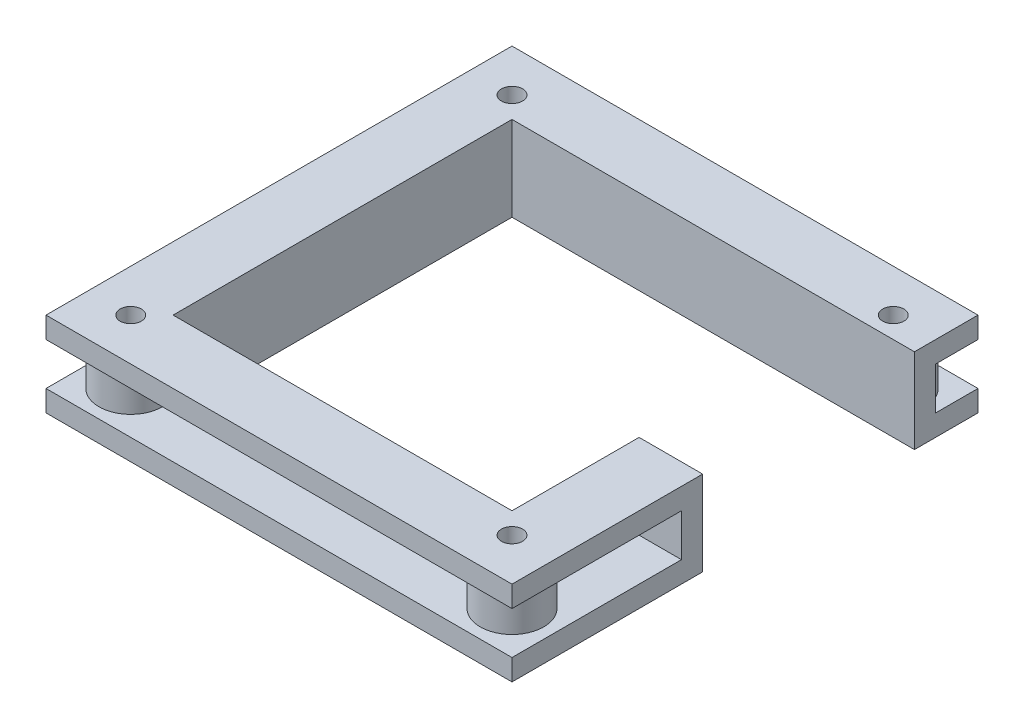
ISO-10303-21;
HEADER;
FILE_DESCRIPTION(('STEP AP214'),'2;1');
FILE_NAME('part.step','',(''),(''),'','','');
FILE_SCHEMA(('AUTOMOTIVE_DESIGN { 1 0 10303 214 1 1 1 1 }'));
ENDSEC;
DATA;
#1=APPLICATION_CONTEXT('core data for automotive mechanical design processes');
#2=APPLICATION_PROTOCOL_DEFINITION('international standard','automotive_design',2000,#1);
#3=PRODUCT_CONTEXT('',#1,'mechanical');
#4=PRODUCT('Part','Part','',(#3));
#5=PRODUCT_RELATED_PRODUCT_CATEGORY('part','',(#4));
#6=PRODUCT_DEFINITION_FORMATION('','',#4);
#7=PRODUCT_DEFINITION_CONTEXT('part definition',#1,'design');
#8=PRODUCT_DEFINITION('design','',#6,#7);
#9=PRODUCT_DEFINITION_SHAPE('','',#8);
#10=(LENGTH_UNIT() NAMED_UNIT(*) SI_UNIT(.MILLI.,.METRE.));
#11=(NAMED_UNIT(*) PLANE_ANGLE_UNIT() SI_UNIT($,.RADIAN.));
#12=(NAMED_UNIT(*) SI_UNIT($,.STERADIAN.) SOLID_ANGLE_UNIT());
#13=UNCERTAINTY_MEASURE_WITH_UNIT(LENGTH_MEASURE(1.E-05),#10,'distance_accuracy_value','');
#14=(GEOMETRIC_REPRESENTATION_CONTEXT(3) GLOBAL_UNCERTAINTY_ASSIGNED_CONTEXT((#13)) GLOBAL_UNIT_ASSIGNED_CONTEXT((#10,
#11,#12)) REPRESENTATION_CONTEXT('',''));
#15=CARTESIAN_POINT('',(0.,0.,0.));
#16=DIRECTION('',(0.,0.,1.));
#17=DIRECTION('',(1.,0.,0.));
#18=AXIS2_PLACEMENT_3D('',#15,#16,#17);
#19=CARTESIAN_POINT('',(-20.,40.,0.));
#20=DIRECTION('',(-1.,0.,0.));
#21=DIRECTION('',(0.,0.,1.));
#22=AXIS2_PLACEMENT_3D('',#19,#20,#21);
#23=PLANE('',#22);
#24=DIRECTION('',(0.,-1.,0.));
#25=VECTOR('',#24,1.);
#26=CARTESIAN_POINT('',(-20.,40.,20.));
#27=LINE('',#26,#25);
#28=CARTESIAN_POINT('',(-20.,10.,20.));
#29=VERTEX_POINT('',#28);
#30=CARTESIAN_POINT('',(-20.,0.,20.));
#31=VERTEX_POINT('',#30);
#32=EDGE_CURVE('E57',#29,#31,#27,.T.);
#33=ORIENTED_EDGE('',*,*,#32,.F.);
#34=DIRECTION('',(0.,0.,-1.));
#35=VECTOR('',#34,1.);
#36=CARTESIAN_POINT('',(-20.,10.,0.));
#37=LINE('',#36,#35);
#38=CARTESIAN_POINT('',(-20.,10.,-200.));
#39=VERTEX_POINT('',#38);
#40=EDGE_CURVE('E265',#29,#39,#37,.T.);
#41=ORIENTED_EDGE('',*,*,#40,.T.);
#42=DIRECTION('',(0.,-1.,0.));
#43=VECTOR('',#42,1.);
#44=CARTESIAN_POINT('',(-20.,40.,-200.));
#45=LINE('',#44,#43);
#46=CARTESIAN_POINT('',(-20.,0.,-200.));
#47=VERTEX_POINT('',#46);
#48=EDGE_CURVE('E431',#39,#47,#45,.T.);
#49=ORIENTED_EDGE('',*,*,#48,.T.);
#50=DIRECTION('',(0.,0.,-1.));
#51=VECTOR('',#50,1.);
#52=CARTESIAN_POINT('',(-20.,0.,0.));
#53=LINE('',#52,#51);
#54=EDGE_CURVE('E410',#31,#47,#53,.T.);
#55=ORIENTED_EDGE('',*,*,#54,.F.);
#56=EDGE_LOOP('',(#33,#41,#49,#55));
#57=FACE_BOUND('',#56,.T.);
#58=ADVANCED_FACE('F47',(#57),#23,.T.);
#59=CARTESIAN_POINT('',(0.,40.,20.));
#60=DIRECTION('',(0.,0.,-1.));
#61=DIRECTION('',(-1.,0.,0.));
#62=AXIS2_PLACEMENT_3D('',#59,#60,#61);
#63=PLANE('',#62);
#64=DIRECTION('',(1.,0.,0.));
#65=VECTOR('',#64,1.);
#66=CARTESIAN_POINT('',(0.,10.,20.));
#67=LINE('',#66,#65);
#68=CARTESIAN_POINT('',(200.,10.,20.));
#69=VERTEX_POINT('',#68);
#70=EDGE_CURVE('E259',#29,#69,#67,.T.);
#71=ORIENTED_EDGE('',*,*,#70,.F.);
#72=ORIENTED_EDGE('',*,*,#32,.T.);
#73=DIRECTION('',(1.,0.,0.));
#74=VECTOR('',#73,1.);
#75=CARTESIAN_POINT('',(0.,0.,20.));
#76=LINE('',#75,#74);
#77=CARTESIAN_POINT('',(200.,0.,20.));
#78=VERTEX_POINT('',#77);
#79=EDGE_CURVE('E414',#31,#78,#76,.T.);
#80=ORIENTED_EDGE('',*,*,#79,.T.);
#81=DIRECTION('',(0.,-1.,0.));
#82=VECTOR('',#81,1.);
#83=CARTESIAN_POINT('',(200.,40.,20.));
#84=LINE('',#83,#82);
#85=EDGE_CURVE('E436',#69,#78,#84,.T.);
#86=ORIENTED_EDGE('',*,*,#85,.F.);
#87=EDGE_LOOP('',(#71,#72,#80,#86));
#88=FACE_BOUND('',#87,.T.);
#89=ADVANCED_FACE('F588',(#88),#63,.F.);
#90=CARTESIAN_POINT('',(200.,40.,0.));
#91=DIRECTION('',(-1.,0.,0.));
#92=DIRECTION('',(0.,0.,1.));
#93=AXIS2_PLACEMENT_3D('',#90,#91,#92);
#94=PLANE('',#93);
#95=DIRECTION('',(0.,0.,-1.));
#96=VECTOR('',#95,1.);
#97=CARTESIAN_POINT('',(200.,10.,0.));
#98=LINE('',#97,#96);
#99=CARTESIAN_POINT('',(200.,10.,-60.));
#100=VERTEX_POINT('',#99);
#101=EDGE_CURVE('E236',#69,#100,#98,.T.);
#102=ORIENTED_EDGE('',*,*,#101,.F.);
#103=ORIENTED_EDGE('',*,*,#85,.T.);
#104=DIRECTION('',(0.,0.,-1.));
#105=VECTOR('',#104,1.);
#106=CARTESIAN_POINT('',(200.,0.,0.));
#107=LINE('',#106,#105);
#108=CARTESIAN_POINT('',(200.,0.,-70.));
#109=VERTEX_POINT('',#108);
#110=EDGE_CURVE('E419',#78,#109,#107,.T.);
#111=ORIENTED_EDGE('',*,*,#110,.T.);
#112=DIRECTION('',(0.,1.,0.));
#113=VECTOR('',#112,1.);
#114=CARTESIAN_POINT('',(200.,0.,-70.));
#115=LINE('',#114,#113);
#116=CARTESIAN_POINT('',(200.,40.,-70.));
#117=VERTEX_POINT('',#116);
#118=EDGE_CURVE('E73',#109,#117,#115,.T.);
#119=ORIENTED_EDGE('',*,*,#118,.T.);
#120=DIRECTION('',(0.,0.,-1.));
#121=VECTOR('',#120,1.);
#122=CARTESIAN_POINT('',(200.,40.,0.));
#123=LINE('',#122,#121);
#124=CARTESIAN_POINT('',(200.,40.,20.));
#125=VERTEX_POINT('',#124);
#126=EDGE_CURVE('E371',#125,#117,#123,.T.);
#127=ORIENTED_EDGE('',*,*,#126,.F.);
#128=CARTESIAN_POINT('',(200.,30.,20.));
#129=VERTEX_POINT('',#128);
#130=EDGE_CURVE('E437',#125,#129,#84,.T.);
#131=ORIENTED_EDGE('',*,*,#130,.T.);
#132=DIRECTION('',(0.,0.,-1.));
#133=VECTOR('',#132,1.);
#134=CARTESIAN_POINT('',(200.,30.,0.));
#135=LINE('',#134,#133);
#136=CARTESIAN_POINT('',(200.,30.,-60.));
#137=VERTEX_POINT('',#136);
#138=EDGE_CURVE('E273',#129,#137,#135,.T.);
#139=ORIENTED_EDGE('',*,*,#138,.T.);
#140=DIRECTION('',(0.,1.,0.));
#141=VECTOR('',#140,1.);
#142=CARTESIAN_POINT('',(200.,40.,-60.));
#143=LINE('',#142,#141);
#144=EDGE_CURVE('E246',#100,#137,#143,.T.);
#145=ORIENTED_EDGE('',*,*,#144,.F.);
#146=EDGE_LOOP('',(#102,#103,#111,#119,#127,#131,#139,#145));
#147=FACE_BOUND('',#146,.T.);
#148=ADVANCED_FACE('F536',(#147),#94,.F.);
#149=CARTESIAN_POINT('',(0.,40.,-200.));
#150=DIRECTION('',(0.,0.,-1.));
#151=DIRECTION('',(-1.,0.,0.));
#152=AXIS2_PLACEMENT_3D('',#149,#150,#151);
#153=PLANE('',#152);
#154=ORIENTED_EDGE('',*,*,#48,.F.);
#155=DIRECTION('',(1.,0.,0.));
#156=VECTOR('',#155,1.);
#157=CARTESIAN_POINT('',(0.,10.,-200.));
#158=LINE('',#157,#156);
#159=CARTESIAN_POINT('',(200.,10.,-200.));
#160=VERTEX_POINT('',#159);
#161=EDGE_CURVE('E260',#39,#160,#158,.T.);
#162=ORIENTED_EDGE('',*,*,#161,.T.);
#163=DIRECTION('',(0.,-1.,0.));
#164=VECTOR('',#163,1.);
#165=CARTESIAN_POINT('',(200.,40.,-200.));
#166=LINE('',#165,#164);
#167=CARTESIAN_POINT('',(200.,0.,-200.));
#168=VERTEX_POINT('',#167);
#169=EDGE_CURVE('E430',#160,#168,#166,.T.);
#170=ORIENTED_EDGE('',*,*,#169,.T.);
#171=DIRECTION('',(1.,0.,0.));
#172=VECTOR('',#171,1.);
#173=CARTESIAN_POINT('',(0.,0.,-200.));
#174=LINE('',#173,#172);
#175=EDGE_CURVE('E335',#47,#168,#174,.T.);
#176=ORIENTED_EDGE('',*,*,#175,.F.);
#177=EDGE_LOOP('',(#154,#162,#170,#176));
#178=FACE_BOUND('',#177,.T.);
#179=ADVANCED_FACE('F464',(#178),#153,.T.);
#180=DIRECTION('',(0.,1.,0.));
#181=VECTOR('',#180,1.);
#182=CARTESIAN_POINT('',(200.,40.,-180.));
#183=LINE('',#182,#181);
#184=CARTESIAN_POINT('',(200.,10.,-180.));
#185=VERTEX_POINT('',#184);
#186=CARTESIAN_POINT('',(200.,30.,-180.));
#187=VERTEX_POINT('',#186);
#188=EDGE_CURVE('E249',#185,#187,#183,.T.);
#189=ORIENTED_EDGE('',*,*,#188,.T.);
#190=DIRECTION('',(0.,0.,-1.));
#191=VECTOR('',#190,1.);
#192=CARTESIAN_POINT('',(200.,30.,0.));
#193=LINE('',#192,#191);
#194=CARTESIAN_POINT('',(200.,30.,-200.));
#195=VERTEX_POINT('',#194);
#196=EDGE_CURVE('E278',#187,#195,#193,.T.);
#197=ORIENTED_EDGE('',*,*,#196,.T.);
#198=CARTESIAN_POINT('',(200.,40.,-200.));
#199=VERTEX_POINT('',#198);
#200=EDGE_CURVE('E432',#199,#195,#166,.T.);
#201=ORIENTED_EDGE('',*,*,#200,.F.);
#202=CARTESIAN_POINT('',(200.,40.,-170.));
#203=VERTEX_POINT('',#202);
#204=EDGE_CURVE('E370',#203,#199,#123,.T.);
#205=ORIENTED_EDGE('',*,*,#204,.F.);
#206=DIRECTION('',(0.,1.,0.));
#207=VECTOR('',#206,1.);
#208=CARTESIAN_POINT('',(200.,0.,-170.));
#209=LINE('',#208,#207);
#210=CARTESIAN_POINT('',(200.,0.,-170.));
#211=VERTEX_POINT('',#210);
#212=EDGE_CURVE('E321',#211,#203,#209,.T.);
#213=ORIENTED_EDGE('',*,*,#212,.F.);
#214=EDGE_CURVE('E418',#211,#168,#107,.T.);
#215=ORIENTED_EDGE('',*,*,#214,.T.);
#216=ORIENTED_EDGE('',*,*,#169,.F.);
#217=DIRECTION('',(0.,0.,-1.));
#218=VECTOR('',#217,1.);
#219=CARTESIAN_POINT('',(200.,10.,0.));
#220=LINE('',#219,#218);
#221=EDGE_CURVE('E256',#185,#160,#220,.T.);
#222=ORIENTED_EDGE('',*,*,#221,.F.);
#223=EDGE_LOOP('',(#189,#197,#201,#205,#213,#215,#216,#222));
#224=FACE_BOUND('',#223,.T.);
#225=ADVANCED_FACE('F471',(#224),#94,.F.);
#226=DIRECTION('',(0.,0.,-1.));
#227=VECTOR('',#226,1.);
#228=CARTESIAN_POINT('',(-20.,30.,0.));
#229=LINE('',#228,#227);
#230=CARTESIAN_POINT('',(-20.,30.,20.));
#231=VERTEX_POINT('',#230);
#232=CARTESIAN_POINT('',(-20.,30.,-200.));
#233=VERTEX_POINT('',#232);
#234=EDGE_CURVE('E65',#231,#233,#229,.T.);
#235=ORIENTED_EDGE('',*,*,#234,.F.);
#236=CARTESIAN_POINT('',(-20.,40.,20.));
#237=VERTEX_POINT('',#236);
#238=EDGE_CURVE('E11',#237,#231,#27,.T.);
#239=ORIENTED_EDGE('',*,*,#238,.F.);
#240=DIRECTION('',(0.,0.,-1.));
#241=VECTOR('',#240,1.);
#242=CARTESIAN_POINT('',(-20.,40.,0.));
#243=LINE('',#242,#241);
#244=CARTESIAN_POINT('',(-20.,40.,-200.));
#245=VERTEX_POINT('',#244);
#246=EDGE_CURVE('E362',#237,#245,#243,.T.);
#247=ORIENTED_EDGE('',*,*,#246,.T.);
#248=EDGE_CURVE('E426',#245,#233,#45,.T.);
#249=ORIENTED_EDGE('',*,*,#248,.T.);
#250=EDGE_LOOP('',(#235,#239,#247,#249));
#251=FACE_BOUND('',#250,.T.);
#252=ADVANCED_FACE('F543',(#251),#23,.T.);
#253=ORIENTED_EDGE('',*,*,#238,.T.);
#254=DIRECTION('',(1.,0.,0.));
#255=VECTOR('',#254,1.);
#256=CARTESIAN_POINT('',(0.,30.,20.));
#257=LINE('',#256,#255);
#258=EDGE_CURVE('E279',#231,#129,#257,.T.);
#259=ORIENTED_EDGE('',*,*,#258,.T.);
#260=ORIENTED_EDGE('',*,*,#130,.F.);
#261=DIRECTION('',(1.,0.,0.));
#262=VECTOR('',#261,1.);
#263=CARTESIAN_POINT('',(0.,40.,20.));
#264=LINE('',#263,#262);
#265=EDGE_CURVE('E366',#237,#125,#264,.T.);
#266=ORIENTED_EDGE('',*,*,#265,.F.);
#267=EDGE_LOOP('',(#253,#259,#260,#266));
#268=FACE_BOUND('',#267,.T.);
#269=ADVANCED_FACE('F540',(#268),#63,.F.);
#270=CARTESIAN_POINT('',(0.,40.,-10.));
#271=DIRECTION('',(0.,0.,-1.));
#272=DIRECTION('',(-1.,0.,0.));
#273=AXIS2_PLACEMENT_3D('',#270,#271,#272);
#274=PLANE('',#273);
#275=DIRECTION('',(1.,0.,0.));
#276=VECTOR('',#275,1.);
#277=CARTESIAN_POINT('',(0.,0.,-10.));
#278=LINE('',#277,#276);
#279=CARTESIAN_POINT('',(10.,0.,-10.));
#280=VERTEX_POINT('',#279);
#281=CARTESIAN_POINT('',(170.,0.,-10.));
#282=VERTEX_POINT('',#281);
#283=EDGE_CURVE('E391',#280,#282,#278,.T.);
#284=ORIENTED_EDGE('',*,*,#283,.F.);
#285=DIRECTION('',(0.,-1.,0.));
#286=VECTOR('',#285,1.);
#287=CARTESIAN_POINT('',(10.,40.,-10.));
#288=LINE('',#287,#286);
#289=CARTESIAN_POINT('',(10.,40.,-10.));
#290=VERTEX_POINT('',#289);
#291=EDGE_CURVE('E51',#290,#280,#288,.T.);
#292=ORIENTED_EDGE('',*,*,#291,.F.);
#293=DIRECTION('',(1.,0.,0.));
#294=VECTOR('',#293,1.);
#295=CARTESIAN_POINT('',(0.,40.,-10.));
#296=LINE('',#295,#294);
#297=CARTESIAN_POINT('',(170.,40.,-10.));
#298=VERTEX_POINT('',#297);
#299=EDGE_CURVE('E343',#290,#298,#296,.T.);
#300=ORIENTED_EDGE('',*,*,#299,.T.);
#301=DIRECTION('',(0.,-1.,0.));
#302=VECTOR('',#301,1.);
#303=CARTESIAN_POINT('',(170.,40.,-10.));
#304=LINE('',#303,#302);
#305=EDGE_CURVE('E379',#298,#282,#304,.T.);
#306=ORIENTED_EDGE('',*,*,#305,.T.);
#307=EDGE_LOOP('',(#284,#292,#300,#306));
#308=FACE_BOUND('',#307,.T.);
#309=ADVANCED_FACE('F602',(#308),#274,.T.);
#310=CARTESIAN_POINT('',(10.,40.,0.));
#311=DIRECTION('',(-1.,0.,0.));
#312=DIRECTION('',(0.,0.,1.));
#313=AXIS2_PLACEMENT_3D('',#310,#311,#312);
#314=PLANE('',#313);
#315=DIRECTION('',(0.,0.,-1.));
#316=VECTOR('',#315,1.);
#317=CARTESIAN_POINT('',(10.,0.,0.));
#318=LINE('',#317,#316);
#319=CARTESIAN_POINT('',(10.,0.,-170.));
#320=VERTEX_POINT('',#319);
#321=EDGE_CURVE('E395',#280,#320,#318,.T.);
#322=ORIENTED_EDGE('',*,*,#321,.T.);
#323=DIRECTION('',(0.,-1.,0.));
#324=VECTOR('',#323,1.);
#325=CARTESIAN_POINT('',(10.,40.,-170.));
#326=LINE('',#325,#324);
#327=CARTESIAN_POINT('',(10.,40.,-170.));
#328=VERTEX_POINT('',#327);
#329=EDGE_CURVE('E442',#328,#320,#326,.T.);
#330=ORIENTED_EDGE('',*,*,#329,.F.);
#331=DIRECTION('',(0.,0.,-1.));
#332=VECTOR('',#331,1.);
#333=CARTESIAN_POINT('',(10.,40.,0.));
#334=LINE('',#333,#332);
#335=EDGE_CURVE('E347',#290,#328,#334,.T.);
#336=ORIENTED_EDGE('',*,*,#335,.F.);
#337=ORIENTED_EDGE('',*,*,#291,.T.);
#338=EDGE_LOOP('',(#322,#330,#336,#337));
#339=FACE_BOUND('',#338,.T.);
#340=ADVANCED_FACE('F779',(#339),#314,.F.);
#341=CARTESIAN_POINT('',(0.,40.,-170.));
#342=DIRECTION('',(0.,0.,-1.));
#343=DIRECTION('',(-1.,0.,0.));
#344=AXIS2_PLACEMENT_3D('',#341,#342,#343);
#345=PLANE('',#344);
#346=DIRECTION('',(1.,0.,0.));
#347=VECTOR('',#346,1.);
#348=CARTESIAN_POINT('',(0.,0.,-170.));
#349=LINE('',#348,#347);
#350=EDGE_CURVE('E399',#320,#211,#349,.T.);
#351=ORIENTED_EDGE('',*,*,#350,.T.);
#352=ORIENTED_EDGE('',*,*,#212,.T.);
#353=DIRECTION('',(1.,0.,0.));
#354=VECTOR('',#353,1.);
#355=CARTESIAN_POINT('',(0.,40.,-170.));
#356=LINE('',#355,#354);
#357=EDGE_CURVE('E351',#328,#203,#356,.T.);
#358=ORIENTED_EDGE('',*,*,#357,.F.);
#359=ORIENTED_EDGE('',*,*,#329,.T.);
#360=EDGE_LOOP('',(#351,#352,#358,#359));
#361=FACE_BOUND('',#360,.T.);
#362=ADVANCED_FACE('F783',(#361),#345,.F.);
#363=CARTESIAN_POINT('',(0.,40.,0.));
#364=DIRECTION('',(0.,-1.,0.));
#365=DIRECTION('',(0.,0.,-1.));
#366=AXIS2_PLACEMENT_3D('',#363,#364,#365);
#367=CYLINDRICAL_SURFACE('',#366,5.);
#368=CARTESIAN_POINT('',(0.,40.,0.));
#369=DIRECTION('',(0.,1.,0.));
#370=DIRECTION('',(0.,0.,1.));
#371=AXIS2_PLACEMENT_3D('',#368,#369,#370);
#372=CIRCLE('',#371,5.);
#373=CARTESIAN_POINT('',(0.,40.,5.));
#374=VERTEX_POINT('',#373);
#375=EDGE_CURVE('E358',#374,#374,#372,.F.);
#376=ORIENTED_EDGE('',*,*,#375,.F.);
#377=EDGE_LOOP('',(#376));
#378=FACE_BOUND('',#377,.T.);
#379=CARTESIAN_POINT('',(0.,0.,0.));
#380=DIRECTION('',(0.,1.,0.));
#381=DIRECTION('',(0.,0.,1.));
#382=AXIS2_PLACEMENT_3D('',#379,#380,#381);
#383=CIRCLE('',#382,5.);
#384=CARTESIAN_POINT('',(0.,0.,5.));
#385=VERTEX_POINT('',#384);
#386=EDGE_CURVE('E406',#385,#385,#383,.F.);
#387=ORIENTED_EDGE('',*,*,#386,.T.);
#388=EDGE_LOOP('',(#387));
#389=FACE_BOUND('',#388,.T.);
#390=ADVANCED_FACE('F772',(#378,#389),#367,.F.);
#391=CARTESIAN_POINT('',(170.,40.,0.));
#392=DIRECTION('',(-1.,0.,0.));
#393=DIRECTION('',(0.,0.,1.));
#394=AXIS2_PLACEMENT_3D('',#391,#392,#393);
#395=PLANE('',#394);
#396=DIRECTION('',(0.,1.,0.));
#397=VECTOR('',#396,1.);
#398=CARTESIAN_POINT('',(170.,0.,-70.));
#399=LINE('',#398,#397);
#400=CARTESIAN_POINT('',(170.,0.,-70.));
#401=VERTEX_POINT('',#400);
#402=CARTESIAN_POINT('',(170.,40.,-70.));
#403=VERTEX_POINT('',#402);
#404=EDGE_CURVE('E318',#401,#403,#399,.T.);
#405=ORIENTED_EDGE('',*,*,#404,.F.);
#406=DIRECTION('',(0.,0.,-1.));
#407=VECTOR('',#406,1.);
#408=CARTESIAN_POINT('',(170.,0.,0.));
#409=LINE('',#408,#407);
#410=EDGE_CURVE('E402',#282,#401,#409,.T.);
#411=ORIENTED_EDGE('',*,*,#410,.F.);
#412=ORIENTED_EDGE('',*,*,#305,.F.);
#413=DIRECTION('',(0.,0.,-1.));
#414=VECTOR('',#413,1.);
#415=CARTESIAN_POINT('',(170.,40.,0.));
#416=LINE('',#415,#414);
#417=EDGE_CURVE('E354',#298,#403,#416,.T.);
#418=ORIENTED_EDGE('',*,*,#417,.T.);
#419=EDGE_LOOP('',(#405,#411,#412,#418));
#420=FACE_BOUND('',#419,.T.);
#421=ADVANCED_FACE('F765',(#420),#395,.T.);
#422=CARTESIAN_POINT('',(180.,40.,-180.));
#423=DIRECTION('',(0.,-1.,0.));
#424=DIRECTION('',(0.,0.,-1.));
#425=AXIS2_PLACEMENT_3D('',#422,#423,#424);
#426=CYLINDRICAL_SURFACE('',#425,5.00000000000002);
#427=CARTESIAN_POINT('',(180.,40.,-180.));
#428=DIRECTION('',(0.,1.,0.));
#429=DIRECTION('',(0.,0.,1.));
#430=AXIS2_PLACEMENT_3D('',#427,#428,#429);
#431=CIRCLE('',#430,5.00000000000002);
#432=CARTESIAN_POINT('',(180.,40.,-175.));
#433=VERTEX_POINT('',#432);
#434=EDGE_CURVE('E339',#433,#433,#431,.F.);
#435=ORIENTED_EDGE('',*,*,#434,.F.);
#436=EDGE_LOOP('',(#435));
#437=FACE_BOUND('',#436,.T.);
#438=CARTESIAN_POINT('',(180.,0.,-180.));
#439=DIRECTION('',(0.,1.,0.));
#440=DIRECTION('',(0.,0.,1.));
#441=AXIS2_PLACEMENT_3D('',#438,#439,#440);
#442=CIRCLE('',#441,5.00000000000002);
#443=CARTESIAN_POINT('',(180.,0.,-175.));
#444=VERTEX_POINT('',#443);
#445=EDGE_CURVE('E387',#444,#444,#442,.F.);
#446=ORIENTED_EDGE('',*,*,#445,.T.);
#447=EDGE_LOOP('',(#446));
#448=FACE_BOUND('',#447,.T.);
#449=ADVANCED_FACE('F754',(#437,#448),#426,.F.);
#450=CARTESIAN_POINT('',(180.,40.,0.));
#451=DIRECTION('',(0.,-1.,0.));
#452=DIRECTION('',(0.,0.,-1.));
#453=AXIS2_PLACEMENT_3D('',#450,#451,#452);
#454=CYLINDRICAL_SURFACE('',#453,5.00000000000002);
#455=CARTESIAN_POINT('',(180.,40.,0.));
#456=DIRECTION('',(0.,1.,0.));
#457=DIRECTION('',(0.,0.,1.));
#458=AXIS2_PLACEMENT_3D('',#455,#456,#457);
#459=CIRCLE('',#458,5.00000000000002);
#460=CARTESIAN_POINT('',(180.,40.,5.00000000000002));
#461=VERTEX_POINT('',#460);
#462=EDGE_CURVE('E334',#461,#461,#459,.T.);
#463=ORIENTED_EDGE('',*,*,#462,.T.);
#464=EDGE_LOOP('',(#463));
#465=FACE_BOUND('',#464,.T.);
#466=CARTESIAN_POINT('',(180.,0.,0.));
#467=DIRECTION('',(0.,1.,0.));
#468=DIRECTION('',(0.,0.,1.));
#469=AXIS2_PLACEMENT_3D('',#466,#467,#468);
#470=CIRCLE('',#469,5.00000000000002);
#471=CARTESIAN_POINT('',(180.,0.,5.00000000000002));
#472=VERTEX_POINT('',#471);
#473=EDGE_CURVE('E383',#472,#472,#470,.T.);
#474=ORIENTED_EDGE('',*,*,#473,.F.);
#475=EDGE_LOOP('',(#474));
#476=FACE_BOUND('',#475,.T.);
#477=ADVANCED_FACE('F748',(#465,#476),#454,.F.);
#478=CARTESIAN_POINT('',(0.,40.,-180.));
#479=DIRECTION('',(0.,-1.,0.));
#480=DIRECTION('',(0.,0.,-1.));
#481=AXIS2_PLACEMENT_3D('',#478,#479,#480);
#482=CYLINDRICAL_SURFACE('',#481,5.);
#483=CARTESIAN_POINT('',(0.,40.,-180.));
#484=DIRECTION('',(0.,1.,0.));
#485=DIRECTION('',(0.,0.,1.));
#486=AXIS2_PLACEMENT_3D('',#483,#484,#485);
#487=CIRCLE('',#486,5.);
#488=CARTESIAN_POINT('',(0.,40.,-175.));
#489=VERTEX_POINT('',#488);
#490=EDGE_CURVE('E330',#489,#489,#487,.T.);
#491=ORIENTED_EDGE('',*,*,#490,.T.);
#492=EDGE_LOOP('',(#491));
#493=FACE_BOUND('',#492,.T.);
#494=CARTESIAN_POINT('',(0.,0.,-180.));
#495=DIRECTION('',(0.,1.,0.));
#496=DIRECTION('',(0.,0.,1.));
#497=AXIS2_PLACEMENT_3D('',#494,#495,#496);
#498=CIRCLE('',#497,5.);
#499=CARTESIAN_POINT('',(0.,0.,-175.));
#500=VERTEX_POINT('',#499);
#501=EDGE_CURVE('E325',#500,#500,#498,.T.);
#502=ORIENTED_EDGE('',*,*,#501,.F.);
#503=EDGE_LOOP('',(#502));
#504=FACE_BOUND('',#503,.T.);
#505=ADVANCED_FACE('F49',(#493,#504),#482,.F.);
#506=DIRECTION('',(1.,0.,0.));
#507=VECTOR('',#506,1.);
#508=CARTESIAN_POINT('',(0.,30.,-200.));
#509=LINE('',#508,#507);
#510=EDGE_CURVE('E277',#233,#195,#509,.T.);
#511=ORIENTED_EDGE('',*,*,#510,.F.);
#512=ORIENTED_EDGE('',*,*,#248,.F.);
#513=DIRECTION('',(1.,0.,0.));
#514=VECTOR('',#513,1.);
#515=CARTESIAN_POINT('',(0.,40.,-200.));
#516=LINE('',#515,#514);
#517=EDGE_CURVE('E375',#245,#199,#516,.T.);
#518=ORIENTED_EDGE('',*,*,#517,.T.);
#519=ORIENTED_EDGE('',*,*,#200,.T.);
#520=EDGE_LOOP('',(#511,#512,#518,#519));
#521=FACE_BOUND('',#520,.T.);
#522=ADVANCED_FACE('F546',(#521),#153,.T.);
#523=CARTESIAN_POINT('',(0.,40.,0.));
#524=DIRECTION('',(0.,1.,0.));
#525=DIRECTION('',(0.,0.,1.));
#526=AXIS2_PLACEMENT_3D('',#523,#524,#525);
#527=PLANE('',#526);
#528=ORIENTED_EDGE('',*,*,#357,.T.);
#529=ORIENTED_EDGE('',*,*,#204,.T.);
#530=ORIENTED_EDGE('',*,*,#517,.F.);
#531=ORIENTED_EDGE('',*,*,#246,.F.);
#532=ORIENTED_EDGE('',*,*,#265,.T.);
#533=ORIENTED_EDGE('',*,*,#126,.T.);
#534=DIRECTION('',(1.,0.,0.));
#535=VECTOR('',#534,1.);
#536=CARTESIAN_POINT('',(170.,40.,-70.));
#537=LINE('',#536,#535);
#538=EDGE_CURVE('E314',#403,#117,#537,.T.);
#539=ORIENTED_EDGE('',*,*,#538,.F.);
#540=ORIENTED_EDGE('',*,*,#417,.F.);
#541=ORIENTED_EDGE('',*,*,#299,.F.);
#542=ORIENTED_EDGE('',*,*,#335,.T.);
#543=EDGE_LOOP('',(#528,#529,#530,#531,#532,#533,#539,#540,#541,#542));
#544=FACE_BOUND('',#543,.T.);
#545=ORIENTED_EDGE('',*,*,#490,.F.);
#546=EDGE_LOOP('',(#545));
#547=FACE_BOUND('',#546,.T.);
#548=ORIENTED_EDGE('',*,*,#462,.F.);
#549=EDGE_LOOP('',(#548));
#550=FACE_BOUND('',#549,.T.);
#551=ORIENTED_EDGE('',*,*,#434,.T.);
#552=EDGE_LOOP('',(#551));
#553=FACE_BOUND('',#552,.T.);
#554=ORIENTED_EDGE('',*,*,#375,.T.);
#555=EDGE_LOOP('',(#554));
#556=FACE_BOUND('',#555,.T.);
#557=ADVANCED_FACE('F739',(#544,#547,#550,#553,#556),#527,.T.);
#558=CARTESIAN_POINT('',(0.,0.,0.));
#559=DIRECTION('',(0.,1.,0.));
#560=DIRECTION('',(0.,0.,1.));
#561=AXIS2_PLACEMENT_3D('',#558,#559,#560);
#562=PLANE('',#561);
#563=ORIENTED_EDGE('',*,*,#501,.T.);
#564=EDGE_LOOP('',(#563));
#565=FACE_BOUND('',#564,.T.);
#566=ORIENTED_EDGE('',*,*,#473,.T.);
#567=EDGE_LOOP('',(#566));
#568=FACE_BOUND('',#567,.T.);
#569=ORIENTED_EDGE('',*,*,#445,.F.);
#570=EDGE_LOOP('',(#569));
#571=FACE_BOUND('',#570,.T.);
#572=ORIENTED_EDGE('',*,*,#214,.F.);
#573=ORIENTED_EDGE('',*,*,#350,.F.);
#574=ORIENTED_EDGE('',*,*,#321,.F.);
#575=ORIENTED_EDGE('',*,*,#283,.T.);
#576=ORIENTED_EDGE('',*,*,#410,.T.);
#577=DIRECTION('',(1.,0.,0.));
#578=VECTOR('',#577,1.);
#579=CARTESIAN_POINT('',(170.,0.,-70.));
#580=LINE('',#579,#578);
#581=EDGE_CURVE('E315',#401,#109,#580,.T.);
#582=ORIENTED_EDGE('',*,*,#581,.T.);
#583=ORIENTED_EDGE('',*,*,#110,.F.);
#584=ORIENTED_EDGE('',*,*,#79,.F.);
#585=ORIENTED_EDGE('',*,*,#54,.T.);
#586=ORIENTED_EDGE('',*,*,#175,.T.);
#587=EDGE_LOOP('',(#572,#573,#574,#575,#576,#582,#583,#584,#585,#586));
#588=FACE_BOUND('',#587,.T.);
#589=ORIENTED_EDGE('',*,*,#386,.F.);
#590=EDGE_LOOP('',(#589));
#591=FACE_BOUND('',#590,.T.);
#592=ADVANCED_FACE('F461',(#565,#568,#571,#588,#591),#562,.F.);
#593=CARTESIAN_POINT('',(170.,0.,-70.));
#594=DIRECTION('',(0.,0.,1.));
#595=DIRECTION('',(1.,0.,0.));
#596=AXIS2_PLACEMENT_3D('',#593,#594,#595);
#597=PLANE('',#596);
#598=ORIENTED_EDGE('',*,*,#538,.T.);
#599=ORIENTED_EDGE('',*,*,#118,.F.);
#600=ORIENTED_EDGE('',*,*,#581,.F.);
#601=ORIENTED_EDGE('',*,*,#404,.T.);
#602=EDGE_LOOP('',(#598,#599,#600,#601));
#603=FACE_BOUND('',#602,.T.);
#604=ADVANCED_FACE('F624',(#603),#597,.F.);
#605=CARTESIAN_POINT('',(0.,40.,-180.));
#606=DIRECTION('',(0.,0.,-1.));
#607=DIRECTION('',(-1.,0.,0.));
#608=AXIS2_PLACEMENT_3D('',#605,#606,#607);
#609=PLANE('',#608);
#610=DIRECTION('',(1.,0.,0.));
#611=VECTOR('',#610,1.);
#612=CARTESIAN_POINT('',(0.,30.,-180.));
#613=LINE('',#612,#611);
#614=CARTESIAN_POINT('',(15.,30.,-180.));
#615=VERTEX_POINT('',#614);
#616=CARTESIAN_POINT('',(165.,30.,-180.));
#617=VERTEX_POINT('',#616);
#618=EDGE_CURVE('E480',#615,#617,#613,.T.);
#619=ORIENTED_EDGE('',*,*,#618,.T.);
#620=DIRECTION('',(0.,-1.,0.));
#621=VECTOR('',#620,1.);
#622=CARTESIAN_POINT('',(165.,40.,-180.));
#623=LINE('',#622,#621);
#624=CARTESIAN_POINT('',(165.,10.,-180.));
#625=VERTEX_POINT('',#624);
#626=EDGE_CURVE('E300',#625,#617,#623,.F.);
#627=ORIENTED_EDGE('',*,*,#626,.F.);
#628=DIRECTION('',(1.,0.,0.));
#629=VECTOR('',#628,1.);
#630=CARTESIAN_POINT('',(0.,10.,-180.));
#631=LINE('',#630,#629);
#632=CARTESIAN_POINT('',(15.,10.,-180.));
#633=VERTEX_POINT('',#632);
#634=EDGE_CURVE('E510',#633,#625,#631,.T.);
#635=ORIENTED_EDGE('',*,*,#634,.F.);
#636=DIRECTION('',(0.,-1.,0.));
#637=VECTOR('',#636,1.);
#638=CARTESIAN_POINT('',(15.,40.,-180.));
#639=LINE('',#638,#637);
#640=EDGE_CURVE('E308',#615,#633,#639,.T.);
#641=ORIENTED_EDGE('',*,*,#640,.F.);
#642=EDGE_LOOP('',(#619,#627,#635,#641));
#643=FACE_BOUND('',#642,.T.);
#644=ADVANCED_FACE('F561',(#643),#609,.T.);
#645=CARTESIAN_POINT('',(0.,40.,0.));
#646=DIRECTION('',(0.,0.,-1.));
#647=DIRECTION('',(-1.,0.,0.));
#648=AXIS2_PLACEMENT_3D('',#645,#646,#647);
#649=PLANE('',#648);
#650=DIRECTION('',(0.,-1.,0.));
#651=VECTOR('',#650,1.);
#652=CARTESIAN_POINT('',(165.,40.,0.));
#653=LINE('',#652,#651);
#654=CARTESIAN_POINT('',(165.,10.,0.));
#655=VERTEX_POINT('',#654);
#656=CARTESIAN_POINT('',(165.,30.,0.));
#657=VERTEX_POINT('',#656);
#658=EDGE_CURVE('E303',#655,#657,#653,.F.);
#659=ORIENTED_EDGE('',*,*,#658,.T.);
#660=DIRECTION('',(1.,0.,0.));
#661=VECTOR('',#660,1.);
#662=CARTESIAN_POINT('',(0.,30.,0.));
#663=LINE('',#662,#661);
#664=CARTESIAN_POINT('',(15.,30.,0.));
#665=VERTEX_POINT('',#664);
#666=EDGE_CURVE('E490',#665,#657,#663,.T.);
#667=ORIENTED_EDGE('',*,*,#666,.F.);
#668=DIRECTION('',(0.,-1.,0.));
#669=VECTOR('',#668,1.);
#670=CARTESIAN_POINT('',(15.,40.,0.));
#671=LINE('',#670,#669);
#672=CARTESIAN_POINT('',(15.,10.,0.));
#673=VERTEX_POINT('',#672);
#674=EDGE_CURVE('E294',#665,#673,#671,.T.);
#675=ORIENTED_EDGE('',*,*,#674,.T.);
#676=DIRECTION('',(1.,0.,0.));
#677=VECTOR('',#676,1.);
#678=CARTESIAN_POINT('',(0.,10.,0.));
#679=LINE('',#678,#677);
#680=EDGE_CURVE('E516',#673,#655,#679,.T.);
#681=ORIENTED_EDGE('',*,*,#680,.T.);
#682=EDGE_LOOP('',(#659,#667,#675,#681));
#683=FACE_BOUND('',#682,.T.);
#684=ADVANCED_FACE('F572',(#683),#649,.F.);
#685=CARTESIAN_POINT('',(0.,40.,0.));
#686=DIRECTION('',(-1.,0.,0.));
#687=DIRECTION('',(0.,0.,1.));
#688=AXIS2_PLACEMENT_3D('',#685,#686,#687);
#689=PLANE('',#688);
#690=DIRECTION('',(0.,-1.,0.));
#691=VECTOR('',#690,1.);
#692=CARTESIAN_POINT('',(0.,40.,-165.));
#693=LINE('',#692,#691);
#694=CARTESIAN_POINT('',(0.,30.,-165.));
#695=VERTEX_POINT('',#694);
#696=CARTESIAN_POINT('',(0.,10.,-165.));
#697=VERTEX_POINT('',#696);
#698=EDGE_CURVE('E311',#695,#697,#693,.T.);
#699=ORIENTED_EDGE('',*,*,#698,.T.);
#700=DIRECTION('',(0.,0.,-1.));
#701=VECTOR('',#700,1.);
#702=CARTESIAN_POINT('',(0.,10.,0.));
#703=LINE('',#702,#701);
#704=CARTESIAN_POINT('',(0.,10.,-15.));
#705=VERTEX_POINT('',#704);
#706=EDGE_CURVE('E514',#705,#697,#703,.T.);
#707=ORIENTED_EDGE('',*,*,#706,.F.);
#708=DIRECTION('',(0.,-1.,0.));
#709=VECTOR('',#708,1.);
#710=CARTESIAN_POINT('',(0.,40.,-15.));
#711=LINE('',#710,#709);
#712=CARTESIAN_POINT('',(0.,30.,-15.));
#713=VERTEX_POINT('',#712);
#714=EDGE_CURVE('E288',#705,#713,#711,.F.);
#715=ORIENTED_EDGE('',*,*,#714,.T.);
#716=DIRECTION('',(0.,0.,-1.));
#717=VECTOR('',#716,1.);
#718=CARTESIAN_POINT('',(0.,30.,0.));
#719=LINE('',#718,#717);
#720=EDGE_CURVE('E487',#713,#695,#719,.T.);
#721=ORIENTED_EDGE('',*,*,#720,.T.);
#722=EDGE_LOOP('',(#699,#707,#715,#721));
#723=FACE_BOUND('',#722,.T.);
#724=ADVANCED_FACE('F567',(#723),#689,.T.);
#725=DIRECTION('',(0.,-1.,0.));
#726=VECTOR('',#725,1.);
#727=CARTESIAN_POINT('',(195.,40.,-180.));
#728=LINE('',#727,#726);
#729=CARTESIAN_POINT('',(195.,10.,-180.));
#730=VERTEX_POINT('',#729);
#731=CARTESIAN_POINT('',(195.,30.,-180.));
#732=VERTEX_POINT('',#731);
#733=EDGE_CURVE('E297',#730,#732,#728,.F.);
#734=ORIENTED_EDGE('',*,*,#733,.T.);
#735=EDGE_CURVE('E484',#732,#187,#613,.T.);
#736=ORIENTED_EDGE('',*,*,#735,.T.);
#737=ORIENTED_EDGE('',*,*,#188,.F.);
#738=EDGE_CURVE('E229',#730,#185,#631,.T.);
#739=ORIENTED_EDGE('',*,*,#738,.F.);
#740=EDGE_LOOP('',(#734,#736,#737,#739));
#741=FACE_BOUND('',#740,.T.);
#742=ADVANCED_FACE('F553',(#741),#609,.T.);
#743=CARTESIAN_POINT('',(0.,40.,0.));
#744=DIRECTION('',(0.,-1.,0.));
#745=DIRECTION('',(0.,0.,-1.));
#746=AXIS2_PLACEMENT_3D('',#743,#744,#745);
#747=CYLINDRICAL_SURFACE('',#746,15.);
#748=CARTESIAN_POINT('',(0.,30.,0.));
#749=DIRECTION('',(0.,1.,0.));
#750=DIRECTION('',(0.,0.,1.));
#751=AXIS2_PLACEMENT_3D('',#748,#749,#750);
#752=CIRCLE('',#751,15.);
#753=EDGE_CURVE('E285',#665,#713,#752,.F.);
#754=ORIENTED_EDGE('',*,*,#753,.T.);
#755=ORIENTED_EDGE('',*,*,#714,.F.);
#756=CARTESIAN_POINT('',(0.,10.,0.));
#757=DIRECTION('',(0.,1.,0.));
#758=DIRECTION('',(0.,0.,1.));
#759=AXIS2_PLACEMENT_3D('',#756,#757,#758);
#760=CIRCLE('',#759,15.);
#761=EDGE_CURVE('E228',#673,#705,#760,.F.);
#762=ORIENTED_EDGE('',*,*,#761,.F.);
#763=ORIENTED_EDGE('',*,*,#674,.F.);
#764=EDGE_LOOP('',(#754,#755,#762,#763));
#765=FACE_BOUND('',#764,.T.);
#766=ADVANCED_FACE('F578',(#765),#747,.T.);
#767=CARTESIAN_POINT('',(180.,40.,0.));
#768=DIRECTION('',(-1.,0.,0.));
#769=DIRECTION('',(0.,0.,1.));
#770=AXIS2_PLACEMENT_3D('',#767,#768,#769);
#771=PLANE('',#770);
#772=DIRECTION('',(0.,0.,-1.));
#773=VECTOR('',#772,1.);
#774=CARTESIAN_POINT('',(180.,10.,0.));
#775=LINE('',#774,#773);
#776=CARTESIAN_POINT('',(180.,10.,-15.));
#777=VERTEX_POINT('',#776);
#778=CARTESIAN_POINT('',(180.,10.,-60.));
#779=VERTEX_POINT('',#778);
#780=EDGE_CURVE('E216',#777,#779,#775,.T.);
#781=ORIENTED_EDGE('',*,*,#780,.T.);
#782=DIRECTION('',(0.,1.,0.));
#783=VECTOR('',#782,1.);
#784=CARTESIAN_POINT('',(180.,40.,-60.));
#785=LINE('',#784,#783);
#786=CARTESIAN_POINT('',(180.,30.,-60.));
#787=VERTEX_POINT('',#786);
#788=EDGE_CURVE('E221',#779,#787,#785,.T.);
#789=ORIENTED_EDGE('',*,*,#788,.T.);
#790=DIRECTION('',(0.,0.,-1.));
#791=VECTOR('',#790,1.);
#792=CARTESIAN_POINT('',(180.,30.,0.));
#793=LINE('',#792,#791);
#794=CARTESIAN_POINT('',(180.,30.,-15.));
#795=VERTEX_POINT('',#794);
#796=EDGE_CURVE('E477',#795,#787,#793,.T.);
#797=ORIENTED_EDGE('',*,*,#796,.F.);
#798=DIRECTION('',(0.,-1.,0.));
#799=VECTOR('',#798,1.);
#800=CARTESIAN_POINT('',(180.,40.,-15.));
#801=LINE('',#800,#799);
#802=EDGE_CURVE('E223',#777,#795,#801,.F.);
#803=ORIENTED_EDGE('',*,*,#802,.F.);
#804=EDGE_LOOP('',(#781,#789,#797,#803));
#805=FACE_BOUND('',#804,.T.);
#806=ADVANCED_FACE('F218',(#805),#771,.F.);
#807=CARTESIAN_POINT('',(180.,40.,-180.));
#808=DIRECTION('',(0.,-1.,0.));
#809=DIRECTION('',(0.,0.,-1.));
#810=AXIS2_PLACEMENT_3D('',#807,#808,#809);
#811=CYLINDRICAL_SURFACE('',#810,15.);
#812=ORIENTED_EDGE('',*,*,#626,.T.);
#813=CARTESIAN_POINT('',(180.,30.,-180.));
#814=DIRECTION('',(0.,1.,0.));
#815=DIRECTION('',(0.,0.,1.));
#816=AXIS2_PLACEMENT_3D('',#813,#814,#815);
#817=CIRCLE('',#816,15.);
#818=EDGE_CURVE('E494',#617,#732,#817,.F.);
#819=ORIENTED_EDGE('',*,*,#818,.T.);
#820=ORIENTED_EDGE('',*,*,#733,.F.);
#821=CARTESIAN_POINT('',(180.,10.,-180.));
#822=DIRECTION('',(0.,1.,0.));
#823=DIRECTION('',(0.,0.,1.));
#824=AXIS2_PLACEMENT_3D('',#821,#822,#823);
#825=CIRCLE('',#824,15.);
#826=EDGE_CURVE('E520',#625,#730,#825,.F.);
#827=ORIENTED_EDGE('',*,*,#826,.F.);
#828=EDGE_LOOP('',(#812,#819,#820,#827));
#829=FACE_BOUND('',#828,.T.);
#830=ADVANCED_FACE('F557',(#829),#811,.T.);
#831=CARTESIAN_POINT('',(180.,40.,0.));
#832=DIRECTION('',(0.,-1.,0.));
#833=DIRECTION('',(0.,0.,-1.));
#834=AXIS2_PLACEMENT_3D('',#831,#832,#833);
#835=CYLINDRICAL_SURFACE('',#834,15.);
#836=ORIENTED_EDGE('',*,*,#802,.T.);
#837=CARTESIAN_POINT('',(180.,30.,0.));
#838=DIRECTION('',(0.,1.,0.));
#839=DIRECTION('',(0.,0.,1.));
#840=AXIS2_PLACEMENT_3D('',#837,#838,#839);
#841=CIRCLE('',#840,15.);
#842=EDGE_CURVE('E498',#657,#795,#841,.T.);
#843=ORIENTED_EDGE('',*,*,#842,.F.);
#844=ORIENTED_EDGE('',*,*,#658,.F.);
#845=CARTESIAN_POINT('',(180.,10.,0.));
#846=DIRECTION('',(0.,1.,0.));
#847=DIRECTION('',(0.,0.,1.));
#848=AXIS2_PLACEMENT_3D('',#845,#846,#847);
#849=CIRCLE('',#848,15.);
#850=EDGE_CURVE('E524',#655,#777,#849,.T.);
#851=ORIENTED_EDGE('',*,*,#850,.T.);
#852=EDGE_LOOP('',(#836,#843,#844,#851));
#853=FACE_BOUND('',#852,.T.);
#854=ADVANCED_FACE('F577',(#853),#835,.T.);
#855=CARTESIAN_POINT('',(0.,40.,-180.));
#856=DIRECTION('',(0.,-1.,0.));
#857=DIRECTION('',(0.,0.,-1.));
#858=AXIS2_PLACEMENT_3D('',#855,#856,#857);
#859=CYLINDRICAL_SURFACE('',#858,15.);
#860=CARTESIAN_POINT('',(0.,30.,-180.));
#861=DIRECTION('',(0.,1.,0.));
#862=DIRECTION('',(0.,0.,1.));
#863=AXIS2_PLACEMENT_3D('',#860,#861,#862);
#864=CIRCLE('',#863,15.);
#865=EDGE_CURVE('E264',#615,#695,#864,.T.);
#866=ORIENTED_EDGE('',*,*,#865,.F.);
#867=ORIENTED_EDGE('',*,*,#640,.T.);
#868=CARTESIAN_POINT('',(0.,10.,-180.));
#869=DIRECTION('',(0.,1.,0.));
#870=DIRECTION('',(0.,0.,1.));
#871=AXIS2_PLACEMENT_3D('',#868,#869,#870);
#872=CIRCLE('',#871,15.);
#873=EDGE_CURVE('E255',#633,#697,#872,.T.);
#874=ORIENTED_EDGE('',*,*,#873,.T.);
#875=ORIENTED_EDGE('',*,*,#698,.F.);
#876=EDGE_LOOP('',(#866,#867,#874,#875));
#877=FACE_BOUND('',#876,.T.);
#878=ADVANCED_FACE('F564',(#877),#859,.T.);
#879=CARTESIAN_POINT('',(0.,30.,0.));
#880=DIRECTION('',(0.,1.,0.));
#881=DIRECTION('',(0.,0.,1.));
#882=AXIS2_PLACEMENT_3D('',#879,#880,#881);
#883=PLANE('',#882);
#884=ORIENTED_EDGE('',*,*,#666,.T.);
#885=ORIENTED_EDGE('',*,*,#842,.T.);
#886=ORIENTED_EDGE('',*,*,#796,.T.);
#887=DIRECTION('',(1.,0.,0.));
#888=VECTOR('',#887,1.);
#889=CARTESIAN_POINT('',(0.,30.,-60.));
#890=LINE('',#889,#888);
#891=EDGE_CURVE('E241',#787,#137,#890,.T.);
#892=ORIENTED_EDGE('',*,*,#891,.T.);
#893=ORIENTED_EDGE('',*,*,#138,.F.);
#894=ORIENTED_EDGE('',*,*,#258,.F.);
#895=ORIENTED_EDGE('',*,*,#234,.T.);
#896=ORIENTED_EDGE('',*,*,#510,.T.);
#897=ORIENTED_EDGE('',*,*,#196,.F.);
#898=ORIENTED_EDGE('',*,*,#735,.F.);
#899=ORIENTED_EDGE('',*,*,#818,.F.);
#900=ORIENTED_EDGE('',*,*,#618,.F.);
#901=ORIENTED_EDGE('',*,*,#865,.T.);
#902=ORIENTED_EDGE('',*,*,#720,.F.);
#903=ORIENTED_EDGE('',*,*,#753,.F.);
#904=EDGE_LOOP('',(#884,#885,#886,#892,#893,#894,#895,#896,#897,#898,#899,#900,#901,#902,#903));
#905=FACE_BOUND('',#904,.T.);
#906=ADVANCED_FACE('F534',(#905),#883,.F.);
#907=CARTESIAN_POINT('',(0.,10.,0.));
#908=DIRECTION('',(0.,1.,0.));
#909=DIRECTION('',(0.,0.,1.));
#910=AXIS2_PLACEMENT_3D('',#907,#908,#909);
#911=PLANE('',#910);
#912=ORIENTED_EDGE('',*,*,#706,.T.);
#913=ORIENTED_EDGE('',*,*,#873,.F.);
#914=ORIENTED_EDGE('',*,*,#634,.T.);
#915=ORIENTED_EDGE('',*,*,#826,.T.);
#916=ORIENTED_EDGE('',*,*,#738,.T.);
#917=ORIENTED_EDGE('',*,*,#221,.T.);
#918=ORIENTED_EDGE('',*,*,#161,.F.);
#919=ORIENTED_EDGE('',*,*,#40,.F.);
#920=ORIENTED_EDGE('',*,*,#70,.T.);
#921=ORIENTED_EDGE('',*,*,#101,.T.);
#922=DIRECTION('',(1.,0.,0.));
#923=VECTOR('',#922,1.);
#924=CARTESIAN_POINT('',(0.,10.,-60.));
#925=LINE('',#924,#923);
#926=EDGE_CURVE('E232',#779,#100,#925,.T.);
#927=ORIENTED_EDGE('',*,*,#926,.F.);
#928=ORIENTED_EDGE('',*,*,#780,.F.);
#929=ORIENTED_EDGE('',*,*,#850,.F.);
#930=ORIENTED_EDGE('',*,*,#680,.F.);
#931=ORIENTED_EDGE('',*,*,#761,.T.);
#932=EDGE_LOOP('',(#912,#913,#914,#915,#916,#917,#918,#919,#920,#921,#927,#928,#929,#930,#931));
#933=FACE_BOUND('',#932,.T.);
#934=ADVANCED_FACE('F234',(#933),#911,.T.);
#935=CARTESIAN_POINT('',(170.,0.,-60.));
#936=DIRECTION('',(0.,0.,1.));
#937=DIRECTION('',(1.,0.,0.));
#938=AXIS2_PLACEMENT_3D('',#935,#936,#937);
#939=PLANE('',#938);
#940=ORIENTED_EDGE('',*,*,#891,.F.);
#941=ORIENTED_EDGE('',*,*,#788,.F.);
#942=ORIENTED_EDGE('',*,*,#926,.T.);
#943=ORIENTED_EDGE('',*,*,#144,.T.);
#944=EDGE_LOOP('',(#940,#941,#942,#943));
#945=FACE_BOUND('',#944,.T.);
#946=ADVANCED_FACE('F243',(#945),#939,.T.);
#947=CLOSED_SHELL('',(#58,#89,#148,#179,#225,#252,#269,#309,#340,#362,#390,#421,#449,#477,#505,
#522,#557,#592,#604,#644,#684,#724,#742,#766,#806,#830,#854,#878,#906,#934,#946));
#948=MANIFOLD_SOLID_BREP('B2',#947);
#949=ADVANCED_BREP_SHAPE_REPRESENTATION('',(#18,#948),#14);
#950=SHAPE_DEFINITION_REPRESENTATION(#9,#949);
ENDSEC;
END-ISO-10303-21;
